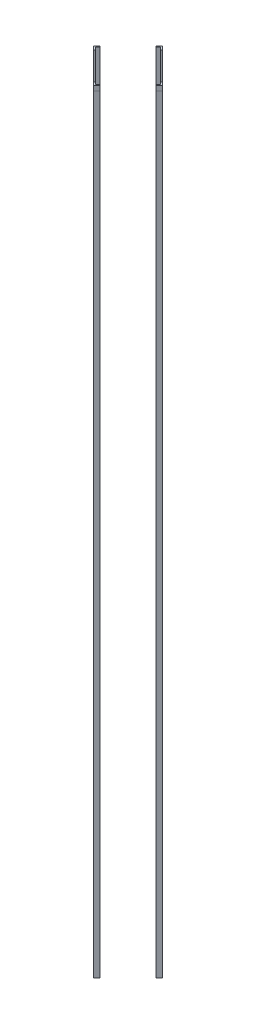
ISO-10303-21;
HEADER;
FILE_DESCRIPTION(('STEP AP214'),'2;1');
FILE_NAME('part.step','',(''),(''),'','','');
FILE_SCHEMA(('AUTOMOTIVE_DESIGN { 1 0 10303 214 1 1 1 1 }'));
ENDSEC;
DATA;
#1=APPLICATION_CONTEXT('core data for automotive mechanical design processes');
#2=APPLICATION_PROTOCOL_DEFINITION('international standard','automotive_design',2000,#1);
#3=PRODUCT_CONTEXT('',#1,'mechanical');
#4=PRODUCT('Part','Part','',(#3));
#5=PRODUCT_RELATED_PRODUCT_CATEGORY('part','',(#4));
#6=PRODUCT_DEFINITION_FORMATION('','',#4);
#7=PRODUCT_DEFINITION_CONTEXT('part definition',#1,'design');
#8=PRODUCT_DEFINITION('design','',#6,#7);
#9=PRODUCT_DEFINITION_SHAPE('','',#8);
#10=(LENGTH_UNIT() NAMED_UNIT(*) SI_UNIT(.MILLI.,.METRE.));
#11=(NAMED_UNIT(*) PLANE_ANGLE_UNIT() SI_UNIT($,.RADIAN.));
#12=(NAMED_UNIT(*) SI_UNIT($,.STERADIAN.) SOLID_ANGLE_UNIT());
#13=UNCERTAINTY_MEASURE_WITH_UNIT(LENGTH_MEASURE(1.E-05),#10,'distance_accuracy_value','');
#14=(GEOMETRIC_REPRESENTATION_CONTEXT(3) GLOBAL_UNCERTAINTY_ASSIGNED_CONTEXT((#13)) GLOBAL_UNIT_ASSIGNED_CONTEXT((#10,
#11,#12)) REPRESENTATION_CONTEXT('',''));
#15=CARTESIAN_POINT('',(0.,0.,0.));
#16=DIRECTION('',(0.,0.,1.));
#17=DIRECTION('',(1.,0.,0.));
#18=AXIS2_PLACEMENT_3D('',#15,#16,#17);
#19=CARTESIAN_POINT('',(-85.7940292392965,2133.6,-8.98025612106698));
#20=DIRECTION('',(0.707106781186548,0.,0.707106781186547));
#21=DIRECTION('',(0.707106781186547,0.,-0.707106781186548));
#22=AXIS2_PLACEMENT_3D('',#19,#20,#21);
#23=PLANE('',#22);
#24=DIRECTION('',(-0.707106781186547,0.,0.707106781186548));
#25=VECTOR('',#24,1.);
#26=CARTESIAN_POINT('',(-85.7940292392965,0.,-8.98025612106698));
#27=LINE('',#26,#25);
#28=CARTESIAN_POINT('',(-85.7940292392965,0.,-8.98025612106698));
#29=VERTEX_POINT('',#28);
#30=CARTESIAN_POINT('',(-94.7742853603657,0.,2.17296172318352E-12));
#31=VERTEX_POINT('',#30);
#32=EDGE_CURVE('E128',#29,#31,#27,.T.);
#33=ORIENTED_EDGE('',*,*,#32,.T.);
#34=DIRECTION('',(0.,-1.,0.));
#35=VECTOR('',#34,1.);
#36=CARTESIAN_POINT('',(-94.7742853603657,2133.6,2.17296172318352E-12));
#37=LINE('',#36,#35);
#38=CARTESIAN_POINT('',(-94.7742853603657,2133.6,2.17296172318352E-12));
#39=VERTEX_POINT('',#38);
#40=EDGE_CURVE('E12',#39,#31,#37,.T.);
#41=ORIENTED_EDGE('',*,*,#40,.F.);
#42=DIRECTION('',(-0.707106781186547,0.,0.707106781186548));
#43=VECTOR('',#42,1.);
#44=CARTESIAN_POINT('',(-85.7940292392965,2133.6,-8.98025612106698));
#45=LINE('',#44,#43);
#46=CARTESIAN_POINT('',(-85.7940292392965,2133.6,-8.98025612106698));
#47=VERTEX_POINT('',#46);
#48=EDGE_CURVE('E138',#47,#39,#45,.T.);
#49=ORIENTED_EDGE('',*,*,#48,.F.);
#50=DIRECTION('',(0.,-1.,0.));
#51=VECTOR('',#50,1.);
#52=CARTESIAN_POINT('',(-85.7940292392965,2133.6,-8.98025612106698));
#53=LINE('',#52,#51);
#54=EDGE_CURVE('E124',#47,#29,#53,.T.);
#55=ORIENTED_EDGE('',*,*,#54,.T.);
#56=EDGE_LOOP('',(#33,#41,#49,#55));
#57=FACE_BOUND('',#56,.T.);
#58=ADVANCED_FACE('F44',(#57),#23,.F.);
#59=CARTESIAN_POINT('',(-94.7742853603657,2133.6,2.17296172318352E-12));
#60=DIRECTION('',(0.707106781186548,0.,-0.707106781186547));
#61=DIRECTION('',(-0.707106781186547,0.,-0.707106781186548));
#62=AXIS2_PLACEMENT_3D('',#59,#60,#61);
#63=PLANE('',#62);
#64=DIRECTION('',(0.707106781186547,0.,0.707106781186548));
#65=VECTOR('',#64,1.);
#66=CARTESIAN_POINT('',(-94.7742853603657,0.,2.17296172318352E-12));
#67=LINE('',#66,#65);
#68=CARTESIAN_POINT('',(-85.7940292392965,0.,8.98025612107132));
#69=VERTEX_POINT('',#68);
#70=EDGE_CURVE('E131',#31,#69,#67,.T.);
#71=ORIENTED_EDGE('',*,*,#70,.T.);
#72=DIRECTION('',(0.,-1.,0.));
#73=VECTOR('',#72,1.);
#74=CARTESIAN_POINT('',(-85.7940292392965,2133.6,8.98025612107132));
#75=LINE('',#74,#73);
#76=CARTESIAN_POINT('',(-85.7940292392965,2133.6,8.98025612107132));
#77=VERTEX_POINT('',#76);
#78=EDGE_CURVE('E52',#77,#69,#75,.T.);
#79=ORIENTED_EDGE('',*,*,#78,.F.);
#80=DIRECTION('',(0.707106781186547,0.,0.707106781186548));
#81=VECTOR('',#80,1.);
#82=CARTESIAN_POINT('',(-94.7742853603657,2133.6,2.17296172318352E-12));
#83=LINE('',#82,#81);
#84=EDGE_CURVE('E97',#39,#77,#83,.T.);
#85=ORIENTED_EDGE('',*,*,#84,.F.);
#86=ORIENTED_EDGE('',*,*,#40,.T.);
#87=EDGE_LOOP('',(#71,#79,#85,#86));
#88=FACE_BOUND('',#87,.T.);
#89=ADVANCED_FACE('F162',(#88),#63,.F.);
#90=CARTESIAN_POINT('',(-85.7940292392965,2133.6,8.98025612107132));
#91=DIRECTION('',(-0.707106781186546,0.,-0.707106781186549));
#92=DIRECTION('',(-0.707106781186549,0.,0.707106781186546));
#93=AXIS2_PLACEMENT_3D('',#90,#91,#92);
#94=PLANE('',#93);
#95=DIRECTION('',(0.707106781186549,0.,-0.707106781186546));
#96=VECTOR('',#95,1.);
#97=CARTESIAN_POINT('',(-85.7940292392965,0.,8.98025612107132));
#98=LINE('',#97,#96);
#99=CARTESIAN_POINT('',(-83.5489652090292,0.,6.73519209080404));
#100=VERTEX_POINT('',#99);
#101=EDGE_CURVE('E133',#69,#100,#98,.T.);
#102=ORIENTED_EDGE('',*,*,#101,.T.);
#103=DIRECTION('',(0.,-1.,0.));
#104=VECTOR('',#103,1.);
#105=CARTESIAN_POINT('',(-83.5489652090292,2133.6,6.73519209080404));
#106=LINE('',#105,#104);
#107=CARTESIAN_POINT('',(-83.5489652090292,2133.6,6.73519209080404));
#108=VERTEX_POINT('',#107);
#109=EDGE_CURVE('E119',#108,#100,#106,.T.);
#110=ORIENTED_EDGE('',*,*,#109,.F.);
#111=DIRECTION('',(0.707106781186549,0.,-0.707106781186546));
#112=VECTOR('',#111,1.);
#113=CARTESIAN_POINT('',(-85.7940292392965,2133.6,8.98025612107132));
#114=LINE('',#113,#112);
#115=EDGE_CURVE('E110',#77,#108,#114,.T.);
#116=ORIENTED_EDGE('',*,*,#115,.F.);
#117=ORIENTED_EDGE('',*,*,#78,.T.);
#118=EDGE_LOOP('',(#102,#110,#116,#117));
#119=FACE_BOUND('',#118,.T.);
#120=ADVANCED_FACE('F144',(#119),#94,.F.);
#121=CARTESIAN_POINT('',(-83.5489652090292,2133.6,6.73519209080404));
#122=DIRECTION('',(-0.707106781186547,0.,0.707106781186548));
#123=DIRECTION('',(0.707106781186548,0.,0.707106781186547));
#124=AXIS2_PLACEMENT_3D('',#121,#122,#123);
#125=PLANE('',#124);
#126=DIRECTION('',(-0.707106781186548,0.,-0.707106781186547));
#127=VECTOR('',#126,1.);
#128=CARTESIAN_POINT('',(-83.5489652090292,0.,6.73519209080404));
#129=LINE('',#128,#127);
#130=CARTESIAN_POINT('',(-90.2841572998311,0.,2.18498927560865E-12));
#131=VERTEX_POINT('',#130);
#132=EDGE_CURVE('E118',#100,#131,#129,.T.);
#133=ORIENTED_EDGE('',*,*,#132,.T.);
#134=DIRECTION('',(0.,-1.,0.));
#135=VECTOR('',#134,1.);
#136=CARTESIAN_POINT('',(-90.2841572998311,2133.6,2.18498927560865E-12));
#137=LINE('',#136,#135);
#138=CARTESIAN_POINT('',(-90.2841572998311,2133.6,2.18498927560865E-12));
#139=VERTEX_POINT('',#138);
#140=EDGE_CURVE('E115',#139,#131,#137,.T.);
#141=ORIENTED_EDGE('',*,*,#140,.F.);
#142=DIRECTION('',(-0.707106781186548,0.,-0.707106781186547));
#143=VECTOR('',#142,1.);
#144=CARTESIAN_POINT('',(-83.5489652090292,2133.6,6.73519209080404));
#145=LINE('',#144,#143);
#146=EDGE_CURVE('E104',#108,#139,#145,.T.);
#147=ORIENTED_EDGE('',*,*,#146,.F.);
#148=ORIENTED_EDGE('',*,*,#109,.T.);
#149=EDGE_LOOP('',(#133,#141,#147,#148));
#150=FACE_BOUND('',#149,.T.);
#151=ADVANCED_FACE('F116',(#150),#125,.F.);
#152=CARTESIAN_POINT('',(-90.2841572998311,2133.6,2.18498927560865E-12));
#153=DIRECTION('',(-0.707106781186548,0.,-0.707106781186547));
#154=DIRECTION('',(-0.707106781186547,0.,0.707106781186548));
#155=AXIS2_PLACEMENT_3D('',#152,#153,#154);
#156=PLANE('',#155);
#157=DIRECTION('',(0.707106781186547,0.,-0.707106781186548));
#158=VECTOR('',#157,1.);
#159=CARTESIAN_POINT('',(-90.2841572998311,0.,2.18498927560865E-12));
#160=LINE('',#159,#158);
#161=CARTESIAN_POINT('',(-83.5489652090292,0.,-6.73519209079969));
#162=VERTEX_POINT('',#161);
#163=EDGE_CURVE('E83',#131,#162,#160,.T.);
#164=ORIENTED_EDGE('',*,*,#163,.T.);
#165=DIRECTION('',(0.,-1.,0.));
#166=VECTOR('',#165,1.);
#167=CARTESIAN_POINT('',(-83.5489652090292,2133.6,-6.73519209079969));
#168=LINE('',#167,#166);
#169=CARTESIAN_POINT('',(-83.5489652090292,2133.6,-6.73519209079969));
#170=VERTEX_POINT('',#169);
#171=EDGE_CURVE('E120',#170,#162,#168,.T.);
#172=ORIENTED_EDGE('',*,*,#171,.F.);
#173=DIRECTION('',(0.707106781186547,0.,-0.707106781186548));
#174=VECTOR('',#173,1.);
#175=CARTESIAN_POINT('',(-90.2841572998311,2133.6,2.18498927560865E-12));
#176=LINE('',#175,#174);
#177=EDGE_CURVE('E108',#139,#170,#176,.T.);
#178=ORIENTED_EDGE('',*,*,#177,.F.);
#179=ORIENTED_EDGE('',*,*,#140,.T.);
#180=EDGE_LOOP('',(#164,#172,#178,#179));
#181=FACE_BOUND('',#180,.T.);
#182=ADVANCED_FACE('F122',(#181),#156,.F.);
#183=CARTESIAN_POINT('',(-83.5489652090292,2133.6,-6.73519209079969));
#184=DIRECTION('',(-0.707106781186547,0.,0.707106781186548));
#185=DIRECTION('',(0.707106781186548,0.,0.707106781186547));
#186=AXIS2_PLACEMENT_3D('',#183,#184,#185);
#187=PLANE('',#186);
#188=DIRECTION('',(-0.707106781186548,0.,-0.707106781186547));
#189=VECTOR('',#188,1.);
#190=CARTESIAN_POINT('',(-83.5489652090292,0.,-6.73519209079969));
#191=LINE('',#190,#189);
#192=EDGE_CURVE('E89',#162,#29,#191,.T.);
#193=ORIENTED_EDGE('',*,*,#192,.T.);
#194=ORIENTED_EDGE('',*,*,#54,.F.);
#195=DIRECTION('',(-0.707106781186548,0.,-0.707106781186547));
#196=VECTOR('',#195,1.);
#197=CARTESIAN_POINT('',(-83.5489652090292,2133.6,-6.73519209079969));
#198=LINE('',#197,#196);
#199=EDGE_CURVE('E60',#170,#47,#198,.T.);
#200=ORIENTED_EDGE('',*,*,#199,.F.);
#201=ORIENTED_EDGE('',*,*,#171,.T.);
#202=EDGE_LOOP('',(#193,#194,#200,#201));
#203=FACE_BOUND('',#202,.T.);
#204=ADVANCED_FACE('F151',(#203),#187,.F.);
#205=CARTESIAN_POINT('',(0.,2133.6,0.));
#206=DIRECTION('',(0.,1.,0.));
#207=DIRECTION('',(0.,0.,1.));
#208=AXIS2_PLACEMENT_3D('',#205,#206,#207);
#209=PLANE('',#208);
#210=ORIENTED_EDGE('',*,*,#48,.T.);
#211=ORIENTED_EDGE('',*,*,#84,.T.);
#212=ORIENTED_EDGE('',*,*,#115,.T.);
#213=ORIENTED_EDGE('',*,*,#146,.T.);
#214=ORIENTED_EDGE('',*,*,#177,.T.);
#215=ORIENTED_EDGE('',*,*,#199,.T.);
#216=EDGE_LOOP('',(#210,#211,#212,#213,#214,#215));
#217=FACE_BOUND('',#216,.T.);
#218=ADVANCED_FACE('F106',(#217),#209,.T.);
#219=CARTESIAN_POINT('',(0.,0.,0.));
#220=DIRECTION('',(0.,1.,0.));
#221=DIRECTION('',(0.,0.,1.));
#222=AXIS2_PLACEMENT_3D('',#219,#220,#221);
#223=PLANE('',#222);
#224=ORIENTED_EDGE('',*,*,#32,.F.);
#225=ORIENTED_EDGE('',*,*,#192,.F.);
#226=ORIENTED_EDGE('',*,*,#163,.F.);
#227=ORIENTED_EDGE('',*,*,#132,.F.);
#228=ORIENTED_EDGE('',*,*,#101,.F.);
#229=ORIENTED_EDGE('',*,*,#70,.F.);
#230=EDGE_LOOP('',(#224,#225,#226,#227,#228,#229));
#231=FACE_BOUND('',#230,.T.);
#232=ADVANCED_FACE('F147',(#231),#223,.F.);
#233=CLOSED_SHELL('',(#58,#89,#120,#151,#182,#204,#218,#232));
#234=MANIFOLD_SOLID_BREP('B2',#233);
#235=CARTESIAN_POINT('',(4.66862972428168E-12,2133.6,94.7742853603679));
#236=DIRECTION('',(-0.707106781186547,0.,-0.707106781186548));
#237=DIRECTION('',(-0.707106781186548,0.,0.707106781186547));
#238=AXIS2_PLACEMENT_3D('',#235,#236,#237);
#239=PLANE('',#238);
#240=DIRECTION('',(0.707106781186547,0.,-0.707106781186547));
#241=VECTOR('',#240,1.);
#242=CARTESIAN_POINT('',(4.7045700668491E-12,2120.9,94.7742853603679));
#243=LINE('',#242,#241);
#244=CARTESIAN_POINT('',(4.7045700668491E-12,2120.9,94.7742853603679));
#245=VERTEX_POINT('',#244);
#246=CARTESIAN_POINT('',(8.98025612107385,2120.9,85.7940292392987));
#247=VERTEX_POINT('',#246);
#248=EDGE_CURVE('E322',#245,#247,#243,.T.);
#249=ORIENTED_EDGE('',*,*,#248,.F.);
#250=DIRECTION('',(0.,-1.,0.));
#251=VECTOR('',#250,1.);
#252=CARTESIAN_POINT('',(4.66862972428168E-12,2133.6,94.7742853603679));
#253=LINE('',#252,#251);
#254=CARTESIAN_POINT('',(4.66862972428168E-12,0.,94.7742853603679));
#255=VERTEX_POINT('',#254);
#256=EDGE_CURVE('E42',#245,#255,#253,.T.);
#257=ORIENTED_EDGE('',*,*,#256,.T.);
#258=DIRECTION('',(0.707106781186548,0.,-0.707106781186547));
#259=VECTOR('',#258,1.);
#260=CARTESIAN_POINT('',(4.66862972428168E-12,0.,94.7742853603679));
#261=LINE('',#260,#259);
#262=CARTESIAN_POINT('',(8.98025612107382,0.,85.7940292392987));
#263=VERTEX_POINT('',#262);
#264=EDGE_CURVE('E328',#255,#263,#261,.T.);
#265=ORIENTED_EDGE('',*,*,#264,.T.);
#266=DIRECTION('',(0.,-1.,0.));
#267=VECTOR('',#266,1.);
#268=CARTESIAN_POINT('',(8.98025612107382,2133.6,85.7940292392987));
#269=LINE('',#268,#267);
#270=EDGE_CURVE('E239',#247,#263,#269,.T.);
#271=ORIENTED_EDGE('',*,*,#270,.F.);
#272=EDGE_LOOP('',(#249,#257,#265,#271));
#273=FACE_BOUND('',#272,.T.);
#274=ADVANCED_FACE('F230',(#273),#239,.F.);
#275=CARTESIAN_POINT('',(-8.98025612106449,2133.6,85.7940292392987));
#276=DIRECTION('',(0.707106781186547,0.,-0.707106781186548));
#277=DIRECTION('',(-0.707106781186548,0.,-0.707106781186547));
#278=AXIS2_PLACEMENT_3D('',#275,#276,#277);
#279=PLANE('',#278);
#280=DIRECTION('',(0.707106781186548,0.,0.707106781186547));
#281=VECTOR('',#280,1.);
#282=CARTESIAN_POINT('',(-8.98025612106449,0.,85.7940292392987));
#283=LINE('',#282,#281);
#284=CARTESIAN_POINT('',(-8.98025612106449,0.,85.7940292392987));
#285=VERTEX_POINT('',#284);
#286=EDGE_CURVE('E326',#285,#255,#283,.T.);
#287=ORIENTED_EDGE('',*,*,#286,.T.);
#288=ORIENTED_EDGE('',*,*,#256,.F.);
#289=DIRECTION('',(-0.707106781186547,0.,-0.707106781186548));
#290=VECTOR('',#289,1.);
#291=CARTESIAN_POINT('',(0.0179605122468429,2120.9,94.79224587261));
#292=LINE('',#291,#290);
#293=CARTESIAN_POINT('',(0.0179605122468429,2120.9,94.79224587261));
#294=VERTEX_POINT('',#293);
#295=EDGE_CURVE('E306',#294,#245,#292,.T.);
#296=ORIENTED_EDGE('',*,*,#295,.F.);
#297=DIRECTION('',(0.,-1.,0.));
#298=VECTOR('',#297,1.);
#299=CARTESIAN_POINT('',(0.0179605122468429,2133.6,94.79224587261));
#300=LINE('',#299,#298);
#301=CARTESIAN_POINT('',(0.0179605122468429,2133.6,94.79224587261));
#302=VERTEX_POINT('',#301);
#303=EDGE_CURVE('E314',#302,#294,#300,.T.);
#304=ORIENTED_EDGE('',*,*,#303,.F.);
#305=DIRECTION('',(0.707106781186548,0.,0.707106781186547));
#306=VECTOR('',#305,1.);
#307=CARTESIAN_POINT('',(-8.98025612106449,2133.6,85.7940292392987));
#308=LINE('',#307,#306);
#309=CARTESIAN_POINT('',(-8.98025612106449,2133.6,85.7940292392987));
#310=VERTEX_POINT('',#309);
#311=EDGE_CURVE('E333',#310,#302,#308,.T.);
#312=ORIENTED_EDGE('',*,*,#311,.F.);
#313=DIRECTION('',(0.,-1.,0.));
#314=VECTOR('',#313,1.);
#315=CARTESIAN_POINT('',(-8.98025612106449,2133.6,85.7940292392987));
#316=LINE('',#315,#314);
#317=EDGE_CURVE('E340',#310,#285,#316,.T.);
#318=ORIENTED_EDGE('',*,*,#317,.T.);
#319=EDGE_LOOP('',(#287,#288,#296,#304,#312,#318));
#320=FACE_BOUND('',#319,.T.);
#321=ADVANCED_FACE('F232',(#320),#279,.F.);
#322=CARTESIAN_POINT('',(8.98025612107382,2133.6,85.7940292392987));
#323=DIRECTION('',(-0.707106781186549,0.,0.707106781186546));
#324=DIRECTION('',(0.707106781186546,0.,0.707106781186549));
#325=AXIS2_PLACEMENT_3D('',#322,#323,#324);
#326=PLANE('',#325);
#327=DIRECTION('',(-0.707106781186546,0.,-0.707106781186549));
#328=VECTOR('',#327,1.);
#329=CARTESIAN_POINT('',(8.98025612107382,0.,85.7940292392987));
#330=LINE('',#329,#328);
#331=CARTESIAN_POINT('',(6.73519209080653,0.,83.5489652090314));
#332=VERTEX_POINT('',#331);
#333=EDGE_CURVE('E344',#263,#332,#330,.T.);
#334=ORIENTED_EDGE('',*,*,#333,.T.);
#335=DIRECTION('',(0.,-1.,0.));
#336=VECTOR('',#335,1.);
#337=CARTESIAN_POINT('',(6.73519209080653,2133.6,83.5489652090314));
#338=LINE('',#337,#336);
#339=CARTESIAN_POINT('',(6.73519209080653,2133.6,83.5489652090314));
#340=VERTEX_POINT('',#339);
#341=EDGE_CURVE('E355',#340,#332,#338,.T.);
#342=ORIENTED_EDGE('',*,*,#341,.F.);
#343=DIRECTION('',(-0.707106781186546,0.,-0.707106781186549));
#344=VECTOR('',#343,1.);
#345=CARTESIAN_POINT('',(8.98025612107382,2133.6,85.7940292392987));
#346=LINE('',#345,#344);
#347=CARTESIAN_POINT('',(8.99821663331599,2133.6,85.8119897515409));
#348=VERTEX_POINT('',#347);
#349=EDGE_CURVE('E283',#348,#340,#346,.T.);
#350=ORIENTED_EDGE('',*,*,#349,.F.);
#351=DIRECTION('',(0.,1.,0.));
#352=VECTOR('',#351,1.);
#353=CARTESIAN_POINT('',(8.99821663331599,2133.6,85.8119897515409));
#354=LINE('',#353,#352);
#355=CARTESIAN_POINT('',(8.99821663331599,2120.9,85.8119897515409));
#356=VERTEX_POINT('',#355);
#357=EDGE_CURVE('E313',#356,#348,#354,.T.);
#358=ORIENTED_EDGE('',*,*,#357,.F.);
#359=DIRECTION('',(-0.707106781186547,0.,-0.707106781186548));
#360=VECTOR('',#359,1.);
#361=CARTESIAN_POINT('',(8.99821663331599,2120.9,85.8119897515409));
#362=LINE('',#361,#360);
#363=EDGE_CURVE('E309',#356,#247,#362,.T.);
#364=ORIENTED_EDGE('',*,*,#363,.T.);
#365=ORIENTED_EDGE('',*,*,#270,.T.);
#366=EDGE_LOOP('',(#334,#342,#350,#358,#364,#365));
#367=FACE_BOUND('',#366,.T.);
#368=ADVANCED_FACE('F359',(#367),#326,.F.);
#369=CARTESIAN_POINT('',(6.73519209080653,2133.6,83.5489652090314));
#370=DIRECTION('',(0.707106781186548,0.,0.707106781186547));
#371=DIRECTION('',(0.707106781186547,0.,-0.707106781186548));
#372=AXIS2_PLACEMENT_3D('',#369,#370,#371);
#373=PLANE('',#372);
#374=DIRECTION('',(-0.707106781186547,0.,0.707106781186548));
#375=VECTOR('',#374,1.);
#376=CARTESIAN_POINT('',(6.73519209080653,0.,83.5489652090314));
#377=LINE('',#376,#375);
#378=CARTESIAN_POINT('',(4.68093221775466E-12,0.,90.2841572998333));
#379=VERTEX_POINT('',#378);
#380=EDGE_CURVE('E346',#332,#379,#377,.T.);
#381=ORIENTED_EDGE('',*,*,#380,.T.);
#382=DIRECTION('',(0.,-1.,0.));
#383=VECTOR('',#382,1.);
#384=CARTESIAN_POINT('',(4.68093221775466E-12,2133.6,90.2841572998333));
#385=LINE('',#384,#383);
#386=CARTESIAN_POINT('',(4.68093221775466E-12,2133.6,90.2841572998333));
#387=VERTEX_POINT('',#386);
#388=EDGE_CURVE('E353',#387,#379,#385,.T.);
#389=ORIENTED_EDGE('',*,*,#388,.F.);
#390=DIRECTION('',(-0.707106781186547,0.,0.707106781186548));
#391=VECTOR('',#390,1.);
#392=CARTESIAN_POINT('',(6.73519209080653,2133.6,83.5489652090314));
#393=LINE('',#392,#391);
#394=EDGE_CURVE('E336',#340,#387,#393,.T.);
#395=ORIENTED_EDGE('',*,*,#394,.F.);
#396=ORIENTED_EDGE('',*,*,#341,.T.);
#397=EDGE_LOOP('',(#381,#389,#395,#396));
#398=FACE_BOUND('',#397,.T.);
#399=ADVANCED_FACE('F369',(#398),#373,.F.);
#400=CARTESIAN_POINT('',(4.68093221775466E-12,2133.6,90.2841572998333));
#401=DIRECTION('',(-0.707106781186547,0.,0.707106781186548));
#402=DIRECTION('',(0.707106781186548,0.,0.707106781186547));
#403=AXIS2_PLACEMENT_3D('',#400,#401,#402);
#404=PLANE('',#403);
#405=DIRECTION('',(-0.707106781186548,0.,-0.707106781186547));
#406=VECTOR('',#405,1.);
#407=CARTESIAN_POINT('',(4.68093221775466E-12,0.,90.2841572998333));
#408=LINE('',#407,#406);
#409=CARTESIAN_POINT('',(-6.7351920907972,0.,83.5489652090314));
#410=VERTEX_POINT('',#409);
#411=EDGE_CURVE('E270',#379,#410,#408,.T.);
#412=ORIENTED_EDGE('',*,*,#411,.T.);
#413=DIRECTION('',(0.,-1.,0.));
#414=VECTOR('',#413,1.);
#415=CARTESIAN_POINT('',(-6.7351920907972,2133.6,83.5489652090314));
#416=LINE('',#415,#414);
#417=CARTESIAN_POINT('',(-6.7351920907972,2133.6,83.5489652090314));
#418=VERTEX_POINT('',#417);
#419=EDGE_CURVE('E351',#418,#410,#416,.T.);
#420=ORIENTED_EDGE('',*,*,#419,.F.);
#421=DIRECTION('',(-0.707106781186548,0.,-0.707106781186547));
#422=VECTOR('',#421,1.);
#423=CARTESIAN_POINT('',(4.68093221775466E-12,2133.6,90.2841572998333));
#424=LINE('',#423,#422);
#425=EDGE_CURVE('E338',#387,#418,#424,.T.);
#426=ORIENTED_EDGE('',*,*,#425,.F.);
#427=ORIENTED_EDGE('',*,*,#388,.T.);
#428=EDGE_LOOP('',(#412,#420,#426,#427));
#429=FACE_BOUND('',#428,.T.);
#430=ADVANCED_FACE('F372',(#429),#404,.F.);
#431=CARTESIAN_POINT('',(-6.7351920907972,2133.6,83.5489652090314));
#432=DIRECTION('',(0.707106781186548,0.,0.707106781186547));
#433=DIRECTION('',(0.707106781186547,0.,-0.707106781186548));
#434=AXIS2_PLACEMENT_3D('',#431,#432,#433);
#435=PLANE('',#434);
#436=DIRECTION('',(-0.707106781186547,0.,0.707106781186548));
#437=VECTOR('',#436,1.);
#438=CARTESIAN_POINT('',(-6.7351920907972,0.,83.5489652090314));
#439=LINE('',#438,#437);
#440=EDGE_CURVE('E276',#410,#285,#439,.T.);
#441=ORIENTED_EDGE('',*,*,#440,.T.);
#442=ORIENTED_EDGE('',*,*,#317,.F.);
#443=DIRECTION('',(-0.707106781186547,0.,0.707106781186548));
#444=VECTOR('',#443,1.);
#445=CARTESIAN_POINT('',(-6.7351920907972,2133.6,83.5489652090314));
#446=LINE('',#445,#444);
#447=EDGE_CURVE('E247',#418,#310,#446,.T.);
#448=ORIENTED_EDGE('',*,*,#447,.F.);
#449=ORIENTED_EDGE('',*,*,#419,.T.);
#450=EDGE_LOOP('',(#441,#442,#448,#449));
#451=FACE_BOUND('',#450,.T.);
#452=ADVANCED_FACE('F375',(#451),#435,.F.);
#453=CARTESIAN_POINT('',(0.,2133.6,0.));
#454=DIRECTION('',(0.,1.,0.));
#455=DIRECTION('',(0.,0.,1.));
#456=AXIS2_PLACEMENT_3D('',#453,#454,#455);
#457=PLANE('',#456);
#458=ORIENTED_EDGE('',*,*,#311,.T.);
#459=DIRECTION('',(-0.707106781186547,0.,0.707106781186547));
#460=VECTOR('',#459,1.);
#461=CARTESIAN_POINT('',(0.0179605122468429,2133.6,94.79224587261));
#462=LINE('',#461,#460);
#463=EDGE_CURVE('E319',#348,#302,#462,.T.);
#464=ORIENTED_EDGE('',*,*,#463,.F.);
#465=ORIENTED_EDGE('',*,*,#349,.T.);
#466=ORIENTED_EDGE('',*,*,#394,.T.);
#467=ORIENTED_EDGE('',*,*,#425,.T.);
#468=ORIENTED_EDGE('',*,*,#447,.T.);
#469=EDGE_LOOP('',(#458,#464,#465,#466,#467,#468));
#470=FACE_BOUND('',#469,.T.);
#471=ADVANCED_FACE('F373',(#470),#457,.T.);
#472=CARTESIAN_POINT('',(0.,0.,0.));
#473=DIRECTION('',(0.,1.,0.));
#474=DIRECTION('',(0.,0.,1.));
#475=AXIS2_PLACEMENT_3D('',#472,#473,#474);
#476=PLANE('',#475);
#477=ORIENTED_EDGE('',*,*,#286,.F.);
#478=ORIENTED_EDGE('',*,*,#440,.F.);
#479=ORIENTED_EDGE('',*,*,#411,.F.);
#480=ORIENTED_EDGE('',*,*,#380,.F.);
#481=ORIENTED_EDGE('',*,*,#333,.F.);
#482=ORIENTED_EDGE('',*,*,#264,.F.);
#483=EDGE_LOOP('',(#477,#478,#479,#480,#481,#482));
#484=FACE_BOUND('',#483,.T.);
#485=ADVANCED_FACE('F366',(#484),#476,.F.);
#486=CARTESIAN_POINT('',(0.0179605122468429,2120.9,94.79224587261));
#487=DIRECTION('',(0.,1.,0.));
#488=DIRECTION('',(0.,0.,1.));
#489=AXIS2_PLACEMENT_3D('',#486,#487,#488);
#490=PLANE('',#489);
#491=ORIENTED_EDGE('',*,*,#248,.T.);
#492=ORIENTED_EDGE('',*,*,#363,.F.);
#493=DIRECTION('',(0.707106781186547,0.,-0.707106781186547));
#494=VECTOR('',#493,1.);
#495=CARTESIAN_POINT('',(0.0179605122468429,2120.9,94.79224587261));
#496=LINE('',#495,#494);
#497=EDGE_CURVE('E302',#294,#356,#496,.T.);
#498=ORIENTED_EDGE('',*,*,#497,.F.);
#499=ORIENTED_EDGE('',*,*,#295,.T.);
#500=EDGE_LOOP('',(#491,#492,#498,#499));
#501=FACE_BOUND('',#500,.T.);
#502=ADVANCED_FACE('F304',(#501),#490,.F.);
#503=CARTESIAN_POINT('',(47.4051031924284,0.,47.4051031924284));
#504=DIRECTION('',(0.707106781186548,0.,0.707106781186548));
#505=DIRECTION('',(0.707106781186548,0.,-0.707106781186548));
#506=AXIS2_PLACEMENT_3D('',#503,#504,#505);
#507=PLANE('',#506);
#508=ORIENTED_EDGE('',*,*,#303,.T.);
#509=ORIENTED_EDGE('',*,*,#497,.T.);
#510=ORIENTED_EDGE('',*,*,#357,.T.);
#511=ORIENTED_EDGE('',*,*,#463,.T.);
#512=EDGE_LOOP('',(#508,#509,#510,#511));
#513=FACE_BOUND('',#512,.T.);
#514=ADVANCED_FACE('F318',(#513),#507,.T.);
#515=CLOSED_SHELL('',(#274,#321,#368,#399,#430,#452,#471,#485,#502,#514));
#516=MANIFOLD_SOLID_BREP('B6',#515);
#517=CARTESIAN_POINT('',(85.7940292393012,2133.6,8.98025612106666));
#518=DIRECTION('',(-0.707106781186548,0.,-0.707106781186547));
#519=DIRECTION('',(-0.707106781186547,0.,0.707106781186548));
#520=AXIS2_PLACEMENT_3D('',#517,#518,#519);
#521=PLANE('',#520);
#522=DIRECTION('',(0.707106781186547,0.,-0.707106781186548));
#523=VECTOR('',#522,1.);
#524=CARTESIAN_POINT('',(85.7940292393012,2120.9,8.98025612106668));
#525=LINE('',#524,#523);
#526=CARTESIAN_POINT('',(85.7940292393012,2120.9,8.98025612106668));
#527=VERTEX_POINT('',#526);
#528=CARTESIAN_POINT('',(94.7742853603704,2120.9,-2.47718512369488E-12));
#529=VERTEX_POINT('',#528);
#530=EDGE_CURVE('E567',#527,#529,#525,.T.);
#531=ORIENTED_EDGE('',*,*,#530,.F.);
#532=DIRECTION('',(0.,-1.,0.));
#533=VECTOR('',#532,1.);
#534=CARTESIAN_POINT('',(85.7940292393012,2133.6,8.98025612106666));
#535=LINE('',#534,#533);
#536=CARTESIAN_POINT('',(85.7940292393012,0.,8.98025612106666));
#537=VERTEX_POINT('',#536);
#538=EDGE_CURVE('E522',#527,#537,#535,.T.);
#539=ORIENTED_EDGE('',*,*,#538,.T.);
#540=DIRECTION('',(0.707106781186547,0.,-0.707106781186548));
#541=VECTOR('',#540,1.);
#542=CARTESIAN_POINT('',(85.7940292393012,0.,8.98025612106666));
#543=LINE('',#542,#541);
#544=CARTESIAN_POINT('',(94.7742853603704,0.,-2.49442212805027E-12));
#545=VERTEX_POINT('',#544);
#546=EDGE_CURVE('E570',#537,#545,#543,.T.);
#547=ORIENTED_EDGE('',*,*,#546,.T.);
#548=DIRECTION('',(0.,-1.,0.));
#549=VECTOR('',#548,1.);
#550=CARTESIAN_POINT('',(94.7742853603704,2133.6,-2.49442212805027E-12));
#551=LINE('',#550,#549);
#552=EDGE_CURVE('E228',#529,#545,#551,.T.);
#553=ORIENTED_EDGE('',*,*,#552,.F.);
#554=EDGE_LOOP('',(#531,#539,#547,#553));
#555=FACE_BOUND('',#554,.T.);
#556=ADVANCED_FACE('F476',(#555),#521,.F.);
#557=CARTESIAN_POINT('',(94.7742853603704,2133.6,-2.49442212805027E-12));
#558=DIRECTION('',(-0.707106781186548,0.,0.707106781186547));
#559=DIRECTION('',(0.707106781186547,0.,0.707106781186548));
#560=AXIS2_PLACEMENT_3D('',#557,#558,#559);
#561=PLANE('',#560);
#562=DIRECTION('',(-0.707106781186547,0.,-0.707106781186548));
#563=VECTOR('',#562,1.);
#564=CARTESIAN_POINT('',(94.7742853603704,0.,-2.49442212805027E-12));
#565=LINE('',#564,#563);
#566=CARTESIAN_POINT('',(85.7940292393012,0.,-8.98025612107165));
#567=VERTEX_POINT('',#566);
#568=EDGE_CURVE('E572',#545,#567,#565,.T.);
#569=ORIENTED_EDGE('',*,*,#568,.T.);
#570=DIRECTION('',(0.,-1.,0.));
#571=VECTOR('',#570,1.);
#572=CARTESIAN_POINT('',(85.7940292393012,2133.6,-8.98025612107165));
#573=LINE('',#572,#571);
#574=CARTESIAN_POINT('',(85.7940292393012,2133.6,-8.98025612107165));
#575=VERTEX_POINT('',#574);
#576=EDGE_CURVE('E484',#575,#567,#573,.T.);
#577=ORIENTED_EDGE('',*,*,#576,.F.);
#578=DIRECTION('',(-0.707106781186547,0.,-0.707106781186548));
#579=VECTOR('',#578,1.);
#580=CARTESIAN_POINT('',(94.7742853603704,2133.6,-2.49442212805027E-12));
#581=LINE('',#580,#579);
#582=CARTESIAN_POINT('',(94.7922458726125,2133.6,0.0179605122396611));
#583=VERTEX_POINT('',#582);
#584=EDGE_CURVE('E529',#583,#575,#581,.T.);
#585=ORIENTED_EDGE('',*,*,#584,.F.);
#586=DIRECTION('',(0.,1.,0.));
#587=VECTOR('',#586,1.);
#588=CARTESIAN_POINT('',(94.7922458726125,2133.6,0.0179605122396611));
#589=LINE('',#588,#587);
#590=CARTESIAN_POINT('',(94.7922458726125,2120.9,0.0179605122396611));
#591=VERTEX_POINT('',#590);
#592=EDGE_CURVE('E558',#591,#583,#589,.T.);
#593=ORIENTED_EDGE('',*,*,#592,.F.);
#594=DIRECTION('',(-0.707106781186548,0.,-0.707106781186547));
#595=VECTOR('',#594,1.);
#596=CARTESIAN_POINT('',(94.7922458726125,2120.9,0.0179605122396611));
#597=LINE('',#596,#595);
#598=EDGE_CURVE('E554',#591,#529,#597,.T.);
#599=ORIENTED_EDGE('',*,*,#598,.T.);
#600=ORIENTED_EDGE('',*,*,#552,.T.);
#601=EDGE_LOOP('',(#569,#577,#585,#593,#599,#600));
#602=FACE_BOUND('',#601,.T.);
#603=ADVANCED_FACE('F622',(#602),#561,.F.);
#604=CARTESIAN_POINT('',(85.7940292393012,2133.6,-8.98025612107165));
#605=DIRECTION('',(0.707106781186546,0.,0.707106781186549));
#606=DIRECTION('',(0.707106781186549,0.,-0.707106781186546));
#607=AXIS2_PLACEMENT_3D('',#604,#605,#606);
#608=PLANE('',#607);
#609=DIRECTION('',(-0.707106781186549,0.,0.707106781186546));
#610=VECTOR('',#609,1.);
#611=CARTESIAN_POINT('',(85.7940292393012,0.,-8.98025612107165));
#612=LINE('',#611,#610);
#613=CARTESIAN_POINT('',(83.5489652090339,0.,-6.73519209080436));
#614=VERTEX_POINT('',#613);
#615=EDGE_CURVE('E587',#567,#614,#612,.T.);
#616=ORIENTED_EDGE('',*,*,#615,.T.);
#617=DIRECTION('',(0.,-1.,0.));
#618=VECTOR('',#617,1.);
#619=CARTESIAN_POINT('',(83.5489652090339,2133.6,-6.73519209080436));
#620=LINE('',#619,#618);
#621=CARTESIAN_POINT('',(83.5489652090339,2133.6,-6.73519209080436));
#622=VERTEX_POINT('',#621);
#623=EDGE_CURVE('E598',#622,#614,#620,.T.);
#624=ORIENTED_EDGE('',*,*,#623,.F.);
#625=DIRECTION('',(-0.707106781186549,0.,0.707106781186546));
#626=VECTOR('',#625,1.);
#627=CARTESIAN_POINT('',(85.7940292393012,2133.6,-8.98025612107165));
#628=LINE('',#627,#626);
#629=EDGE_CURVE('E578',#575,#622,#628,.T.);
#630=ORIENTED_EDGE('',*,*,#629,.F.);
#631=ORIENTED_EDGE('',*,*,#576,.T.);
#632=EDGE_LOOP('',(#616,#624,#630,#631));
#633=FACE_BOUND('',#632,.T.);
#634=ADVANCED_FACE('F604',(#633),#608,.F.);
#635=CARTESIAN_POINT('',(83.5489652090339,2133.6,-6.73519209080436));
#636=DIRECTION('',(0.707106781186547,0.,-0.707106781186548));
#637=DIRECTION('',(-0.707106781186548,0.,-0.707106781186547));
#638=AXIS2_PLACEMENT_3D('',#635,#636,#637);
#639=PLANE('',#638);
#640=DIRECTION('',(0.707106781186548,0.,0.707106781186547));
#641=VECTOR('',#640,1.);
#642=CARTESIAN_POINT('',(83.5489652090339,0.,-6.73519209080436));
#643=LINE('',#642,#641);
#644=CARTESIAN_POINT('',(90.2841572998358,0.,-2.5069995625711E-12));
#645=VERTEX_POINT('',#644);
#646=EDGE_CURVE('E589',#614,#645,#643,.T.);
#647=ORIENTED_EDGE('',*,*,#646,.T.);
#648=DIRECTION('',(0.,-1.,0.));
#649=VECTOR('',#648,1.);
#650=CARTESIAN_POINT('',(90.2841572998358,2133.6,-2.5069995625711E-12));
#651=LINE('',#650,#649);
#652=CARTESIAN_POINT('',(90.2841572998358,2133.6,-2.5069995625711E-12));
#653=VERTEX_POINT('',#652);
#654=EDGE_CURVE('E596',#653,#645,#651,.T.);
#655=ORIENTED_EDGE('',*,*,#654,.F.);
#656=DIRECTION('',(0.707106781186548,0.,0.707106781186547));
#657=VECTOR('',#656,1.);
#658=CARTESIAN_POINT('',(83.5489652090339,2133.6,-6.73519209080436));
#659=LINE('',#658,#657);
#660=EDGE_CURVE('E581',#622,#653,#659,.T.);
#661=ORIENTED_EDGE('',*,*,#660,.F.);
#662=ORIENTED_EDGE('',*,*,#623,.T.);
#663=EDGE_LOOP('',(#647,#655,#661,#662));
#664=FACE_BOUND('',#663,.T.);
#665=ADVANCED_FACE('F615',(#664),#639,.F.);
#666=CARTESIAN_POINT('',(90.2841572998358,2133.6,-2.5069995625711E-12));
#667=DIRECTION('',(0.707106781186548,0.,0.707106781186547));
#668=DIRECTION('',(0.707106781186547,0.,-0.707106781186548));
#669=AXIS2_PLACEMENT_3D('',#666,#667,#668);
#670=PLANE('',#669);
#671=DIRECTION('',(-0.707106781186547,0.,0.707106781186548));
#672=VECTOR('',#671,1.);
#673=CARTESIAN_POINT('',(90.2841572998358,0.,-2.5069995625711E-12));
#674=LINE('',#673,#672);
#675=CARTESIAN_POINT('',(83.5489652090339,0.,6.73519209079937));
#676=VERTEX_POINT('',#675);
#677=EDGE_CURVE('E514',#645,#676,#674,.T.);
#678=ORIENTED_EDGE('',*,*,#677,.T.);
#679=DIRECTION('',(0.,-1.,0.));
#680=VECTOR('',#679,1.);
#681=CARTESIAN_POINT('',(83.5489652090339,2133.6,6.73519209079937));
#682=LINE('',#681,#680);
#683=CARTESIAN_POINT('',(83.5489652090339,2133.6,6.73519209079937));
#684=VERTEX_POINT('',#683);
#685=EDGE_CURVE('E594',#684,#676,#682,.T.);
#686=ORIENTED_EDGE('',*,*,#685,.F.);
#687=DIRECTION('',(-0.707106781186547,0.,0.707106781186548));
#688=VECTOR('',#687,1.);
#689=CARTESIAN_POINT('',(90.2841572998358,2133.6,-2.5069995625711E-12));
#690=LINE('',#689,#688);
#691=EDGE_CURVE('E492',#653,#684,#690,.T.);
#692=ORIENTED_EDGE('',*,*,#691,.F.);
#693=ORIENTED_EDGE('',*,*,#654,.T.);
#694=EDGE_LOOP('',(#678,#686,#692,#693));
#695=FACE_BOUND('',#694,.T.);
#696=ADVANCED_FACE('F617',(#695),#670,.F.);
#697=CARTESIAN_POINT('',(83.5489652090339,2133.6,6.73519209079937));
#698=DIRECTION('',(0.707106781186547,0.,-0.707106781186548));
#699=DIRECTION('',(-0.707106781186548,0.,-0.707106781186547));
#700=AXIS2_PLACEMENT_3D('',#697,#698,#699);
#701=PLANE('',#700);
#702=DIRECTION('',(0.707106781186548,0.,0.707106781186547));
#703=VECTOR('',#702,1.);
#704=CARTESIAN_POINT('',(83.5489652090339,0.,6.73519209079937));
#705=LINE('',#704,#703);
#706=EDGE_CURVE('E579',#676,#537,#705,.T.);
#707=ORIENTED_EDGE('',*,*,#706,.T.);
#708=ORIENTED_EDGE('',*,*,#538,.F.);
#709=DIRECTION('',(-0.707106781186548,0.,-0.707106781186547));
#710=VECTOR('',#709,1.);
#711=CARTESIAN_POINT('',(85.8119897515434,2120.9,8.99821663330881));
#712=LINE('',#711,#710);
#713=CARTESIAN_POINT('',(85.8119897515434,2120.9,8.99821663330881));
#714=VERTEX_POINT('',#713);
#715=EDGE_CURVE('E552',#714,#527,#712,.T.);
#716=ORIENTED_EDGE('',*,*,#715,.F.);
#717=DIRECTION('',(0.,-1.,0.));
#718=VECTOR('',#717,1.);
#719=CARTESIAN_POINT('',(85.8119897515434,2133.6,8.99821663330881));
#720=LINE('',#719,#718);
#721=CARTESIAN_POINT('',(85.8119897515434,2133.6,8.99821663330881));
#722=VERTEX_POINT('',#721);
#723=EDGE_CURVE('E559',#722,#714,#720,.T.);
#724=ORIENTED_EDGE('',*,*,#723,.F.);
#725=DIRECTION('',(0.707106781186548,0.,0.707106781186547));
#726=VECTOR('',#725,1.);
#727=CARTESIAN_POINT('',(83.5489652090339,2133.6,6.73519209079937));
#728=LINE('',#727,#726);
#729=EDGE_CURVE('E584',#684,#722,#728,.T.);
#730=ORIENTED_EDGE('',*,*,#729,.F.);
#731=ORIENTED_EDGE('',*,*,#685,.T.);
#732=EDGE_LOOP('',(#707,#708,#716,#724,#730,#731));
#733=FACE_BOUND('',#732,.T.);
#734=ADVANCED_FACE('F569',(#733),#701,.F.);
#735=CARTESIAN_POINT('',(0.,2133.6,0.));
#736=DIRECTION('',(0.,1.,0.));
#737=DIRECTION('',(0.,0.,1.));
#738=AXIS2_PLACEMENT_3D('',#735,#736,#737);
#739=PLANE('',#738);
#740=ORIENTED_EDGE('',*,*,#729,.T.);
#741=DIRECTION('',(-0.707106781186547,0.,0.707106781186548));
#742=VECTOR('',#741,1.);
#743=CARTESIAN_POINT('',(85.8119897515434,2133.6,8.99821663330881));
#744=LINE('',#743,#742);
#745=EDGE_CURVE('E564',#583,#722,#744,.T.);
#746=ORIENTED_EDGE('',*,*,#745,.F.);
#747=ORIENTED_EDGE('',*,*,#584,.T.);
#748=ORIENTED_EDGE('',*,*,#629,.T.);
#749=ORIENTED_EDGE('',*,*,#660,.T.);
#750=ORIENTED_EDGE('',*,*,#691,.T.);
#751=EDGE_LOOP('',(#740,#746,#747,#748,#749,#750));
#752=FACE_BOUND('',#751,.T.);
#753=ADVANCED_FACE('F618',(#752),#739,.T.);
#754=CARTESIAN_POINT('',(0.,0.,0.));
#755=DIRECTION('',(0.,1.,0.));
#756=DIRECTION('',(0.,0.,1.));
#757=AXIS2_PLACEMENT_3D('',#754,#755,#756);
#758=PLANE('',#757);
#759=ORIENTED_EDGE('',*,*,#546,.F.);
#760=ORIENTED_EDGE('',*,*,#706,.F.);
#761=ORIENTED_EDGE('',*,*,#677,.F.);
#762=ORIENTED_EDGE('',*,*,#646,.F.);
#763=ORIENTED_EDGE('',*,*,#615,.F.);
#764=ORIENTED_EDGE('',*,*,#568,.F.);
#765=EDGE_LOOP('',(#759,#760,#761,#762,#763,#764));
#766=FACE_BOUND('',#765,.T.);
#767=ADVANCED_FACE('F611',(#766),#758,.F.);
#768=CARTESIAN_POINT('',(85.8119897515434,2120.9,8.99821663330881));
#769=DIRECTION('',(0.,1.,0.));
#770=DIRECTION('',(0.,0.,1.));
#771=AXIS2_PLACEMENT_3D('',#768,#769,#770);
#772=PLANE('',#771);
#773=ORIENTED_EDGE('',*,*,#530,.T.);
#774=ORIENTED_EDGE('',*,*,#598,.F.);
#775=DIRECTION('',(0.707106781186547,0.,-0.707106781186548));
#776=VECTOR('',#775,1.);
#777=CARTESIAN_POINT('',(85.8119897515434,2120.9,8.99821663330881));
#778=LINE('',#777,#776);
#779=EDGE_CURVE('E548',#714,#591,#778,.T.);
#780=ORIENTED_EDGE('',*,*,#779,.F.);
#781=ORIENTED_EDGE('',*,*,#715,.T.);
#782=EDGE_LOOP('',(#773,#774,#780,#781));
#783=FACE_BOUND('',#782,.T.);
#784=ADVANCED_FACE('F550',(#783),#772,.F.);
#785=CARTESIAN_POINT('',(47.4051031924261,0.,47.4051031924261));
#786=DIRECTION('',(0.707106781186548,0.,0.707106781186547));
#787=DIRECTION('',(0.707106781186547,0.,-0.707106781186548));
#788=AXIS2_PLACEMENT_3D('',#785,#786,#787);
#789=PLANE('',#788);
#790=ORIENTED_EDGE('',*,*,#723,.T.);
#791=ORIENTED_EDGE('',*,*,#779,.T.);
#792=ORIENTED_EDGE('',*,*,#592,.T.);
#793=ORIENTED_EDGE('',*,*,#745,.T.);
#794=EDGE_LOOP('',(#790,#791,#792,#793));
#795=FACE_BOUND('',#794,.T.);
#796=ADVANCED_FACE('F563',(#795),#789,.T.);
#797=CLOSED_SHELL('',(#556,#603,#634,#665,#696,#734,#753,#767,#784,#796));
#798=MANIFOLD_SOLID_BREP('B36',#797);
#799=CARTESIAN_POINT('',(8.98025612106916,2133.6,-85.7940292392991));
#800=DIRECTION('',(-0.707106781186547,0.,0.707106781186548));
#801=DIRECTION('',(0.707106781186548,0.,0.707106781186547));
#802=AXIS2_PLACEMENT_3D('',#799,#800,#801);
#803=PLANE('',#802);
#804=DIRECTION('',(-0.707106781186548,0.,-0.707106781186547));
#805=VECTOR('',#804,1.);
#806=CARTESIAN_POINT('',(8.98025612106916,0.,-85.7940292392991));
#807=LINE('',#806,#805);
#808=CARTESIAN_POINT('',(8.98025612106916,0.,-85.7940292392991));
#809=VERTEX_POINT('',#808);
#810=CARTESIAN_POINT('',(0.,0.,-94.7742853603682));
#811=VERTEX_POINT('',#810);
#812=EDGE_CURVE('E797',#809,#811,#807,.T.);
#813=ORIENTED_EDGE('',*,*,#812,.T.);
#814=DIRECTION('',(0.,-1.,0.));
#815=VECTOR('',#814,1.);
#816=CARTESIAN_POINT('',(0.,2133.6,-94.7742853603682));
#817=LINE('',#816,#815);
#818=CARTESIAN_POINT('',(0.,2133.6,-94.7742853603682));
#819=VERTEX_POINT('',#818);
#820=EDGE_CURVE('E474',#819,#811,#817,.T.);
#821=ORIENTED_EDGE('',*,*,#820,.F.);
#822=DIRECTION('',(-0.707106781186548,0.,-0.707106781186547));
#823=VECTOR('',#822,1.);
#824=CARTESIAN_POINT('',(8.98025612106916,2133.6,-85.7940292392991));
#825=LINE('',#824,#823);
#826=CARTESIAN_POINT('',(8.98025612106916,2133.6,-85.7940292392991));
#827=VERTEX_POINT('',#826);
#828=EDGE_CURVE('E807',#827,#819,#825,.T.);
#829=ORIENTED_EDGE('',*,*,#828,.F.);
#830=DIRECTION('',(0.,-1.,0.));
#831=VECTOR('',#830,1.);
#832=CARTESIAN_POINT('',(8.98025612106916,2133.6,-85.7940292392991));
#833=LINE('',#832,#831);
#834=EDGE_CURVE('E793',#827,#809,#833,.T.);
#835=ORIENTED_EDGE('',*,*,#834,.T.);
#836=EDGE_LOOP('',(#813,#821,#829,#835));
#837=FACE_BOUND('',#836,.T.);
#838=ADVANCED_FACE('F713',(#837),#803,.F.);
#839=CARTESIAN_POINT('',(0.,2133.6,-94.7742853603682));
#840=DIRECTION('',(0.707106781186547,0.,0.707106781186548));
#841=DIRECTION('',(0.707106781186548,0.,-0.707106781186547));
#842=AXIS2_PLACEMENT_3D('',#839,#840,#841);
#843=PLANE('',#842);
#844=DIRECTION('',(-0.707106781186548,0.,0.707106781186547));
#845=VECTOR('',#844,1.);
#846=CARTESIAN_POINT('',(0.,0.,-94.7742853603682));
#847=LINE('',#846,#845);
#848=CARTESIAN_POINT('',(-8.98025612106914,0.,-85.7940292392991));
#849=VERTEX_POINT('',#848);
#850=EDGE_CURVE('E800',#811,#849,#847,.T.);
#851=ORIENTED_EDGE('',*,*,#850,.T.);
#852=DIRECTION('',(0.,-1.,0.));
#853=VECTOR('',#852,1.);
#854=CARTESIAN_POINT('',(-8.98025612106914,2133.6,-85.7940292392991));
#855=LINE('',#854,#853);
#856=CARTESIAN_POINT('',(-8.98025612106914,2133.6,-85.7940292392991));
#857=VERTEX_POINT('',#856);
#858=EDGE_CURVE('E721',#857,#849,#855,.T.);
#859=ORIENTED_EDGE('',*,*,#858,.F.);
#860=DIRECTION('',(-0.707106781186548,0.,0.707106781186547));
#861=VECTOR('',#860,1.);
#862=CARTESIAN_POINT('',(0.,2133.6,-94.7742853603682));
#863=LINE('',#862,#861);
#864=EDGE_CURVE('E766',#819,#857,#863,.T.);
#865=ORIENTED_EDGE('',*,*,#864,.F.);
#866=ORIENTED_EDGE('',*,*,#820,.T.);
#867=EDGE_LOOP('',(#851,#859,#865,#866));
#868=FACE_BOUND('',#867,.T.);
#869=ADVANCED_FACE('F831',(#868),#843,.F.);
#870=CARTESIAN_POINT('',(-8.98025612106914,2133.6,-85.7940292392991));
#871=DIRECTION('',(0.707106781186546,0.,-0.707106781186549));
#872=DIRECTION('',(-0.707106781186549,0.,-0.707106781186546));
#873=AXIS2_PLACEMENT_3D('',#870,#871,#872);
#874=PLANE('',#873);
#875=DIRECTION('',(0.707106781186549,0.,0.707106781186546));
#876=VECTOR('',#875,1.);
#877=CARTESIAN_POINT('',(-8.98025612106914,0.,-85.7940292392991));
#878=LINE('',#877,#876);
#879=CARTESIAN_POINT('',(-6.73519209080186,0.,-83.5489652090318));
#880=VERTEX_POINT('',#879);
#881=EDGE_CURVE('E802',#849,#880,#878,.T.);
#882=ORIENTED_EDGE('',*,*,#881,.T.);
#883=DIRECTION('',(0.,-1.,0.));
#884=VECTOR('',#883,1.);
#885=CARTESIAN_POINT('',(-6.73519209080186,2133.6,-83.5489652090318));
#886=LINE('',#885,#884);
#887=CARTESIAN_POINT('',(-6.73519209080186,2133.6,-83.5489652090318));
#888=VERTEX_POINT('',#887);
#889=EDGE_CURVE('E788',#888,#880,#886,.T.);
#890=ORIENTED_EDGE('',*,*,#889,.F.);
#891=DIRECTION('',(0.707106781186549,0.,0.707106781186546));
#892=VECTOR('',#891,1.);
#893=CARTESIAN_POINT('',(-8.98025612106914,2133.6,-85.7940292392991));
#894=LINE('',#893,#892);
#895=EDGE_CURVE('E779',#857,#888,#894,.T.);
#896=ORIENTED_EDGE('',*,*,#895,.F.);
#897=ORIENTED_EDGE('',*,*,#858,.T.);
#898=EDGE_LOOP('',(#882,#890,#896,#897));
#899=FACE_BOUND('',#898,.T.);
#900=ADVANCED_FACE('F813',(#899),#874,.F.);
#901=CARTESIAN_POINT('',(-6.73519209080186,2133.6,-83.5489652090318));
#902=DIRECTION('',(-0.707106781186547,0.,-0.707106781186548));
#903=DIRECTION('',(-0.707106781186548,0.,0.707106781186547));
#904=AXIS2_PLACEMENT_3D('',#901,#902,#903);
#905=PLANE('',#904);
#906=DIRECTION('',(0.707106781186548,0.,-0.707106781186547));
#907=VECTOR('',#906,1.);
#908=CARTESIAN_POINT('',(-6.73519209080186,0.,-83.5489652090318));
#909=LINE('',#908,#907);
#910=CARTESIAN_POINT('',(0.,0.,-90.2841572998336));
#911=VERTEX_POINT('',#910);
#912=EDGE_CURVE('E787',#880,#911,#909,.T.);
#913=ORIENTED_EDGE('',*,*,#912,.T.);
#914=DIRECTION('',(0.,-1.,0.));
#915=VECTOR('',#914,1.);
#916=CARTESIAN_POINT('',(0.,2133.6,-90.2841572998336));
#917=LINE('',#916,#915);
#918=CARTESIAN_POINT('',(0.,2133.6,-90.2841572998336));
#919=VERTEX_POINT('',#918);
#920=EDGE_CURVE('E784',#919,#911,#917,.T.);
#921=ORIENTED_EDGE('',*,*,#920,.F.);
#922=DIRECTION('',(0.707106781186548,0.,-0.707106781186547));
#923=VECTOR('',#922,1.);
#924=CARTESIAN_POINT('',(-6.73519209080186,2133.6,-83.5489652090318));
#925=LINE('',#924,#923);
#926=EDGE_CURVE('E773',#888,#919,#925,.T.);
#927=ORIENTED_EDGE('',*,*,#926,.F.);
#928=ORIENTED_EDGE('',*,*,#889,.T.);
#929=EDGE_LOOP('',(#913,#921,#927,#928));
#930=FACE_BOUND('',#929,.T.);
#931=ADVANCED_FACE('F785',(#930),#905,.F.);
#932=CARTESIAN_POINT('',(0.,2133.6,-90.2841572998336));
#933=DIRECTION('',(0.707106781186546,0.,-0.707106781186549));
#934=DIRECTION('',(-0.707106781186549,0.,-0.707106781186546));
#935=AXIS2_PLACEMENT_3D('',#932,#933,#934);
#936=PLANE('',#935);
#937=DIRECTION('',(0.707106781186549,0.,0.707106781186546));
#938=VECTOR('',#937,1.);
#939=CARTESIAN_POINT('',(0.,0.,-90.2841572998336));
#940=LINE('',#939,#938);
#941=CARTESIAN_POINT('',(6.73519209080188,0.,-83.5489652090318));
#942=VERTEX_POINT('',#941);
#943=EDGE_CURVE('E752',#911,#942,#940,.T.);
#944=ORIENTED_EDGE('',*,*,#943,.T.);
#945=DIRECTION('',(0.,-1.,0.));
#946=VECTOR('',#945,1.);
#947=CARTESIAN_POINT('',(6.73519209080188,2133.6,-83.5489652090318));
#948=LINE('',#947,#946);
#949=CARTESIAN_POINT('',(6.73519209080188,2133.6,-83.5489652090318));
#950=VERTEX_POINT('',#949);
#951=EDGE_CURVE('E789',#950,#942,#948,.T.);
#952=ORIENTED_EDGE('',*,*,#951,.F.);
#953=DIRECTION('',(0.707106781186549,0.,0.707106781186546));
#954=VECTOR('',#953,1.);
#955=CARTESIAN_POINT('',(0.,2133.6,-90.2841572998336));
#956=LINE('',#955,#954);
#957=EDGE_CURVE('E777',#919,#950,#956,.T.);
#958=ORIENTED_EDGE('',*,*,#957,.F.);
#959=ORIENTED_EDGE('',*,*,#920,.T.);
#960=EDGE_LOOP('',(#944,#952,#958,#959));
#961=FACE_BOUND('',#960,.T.);
#962=ADVANCED_FACE('F791',(#961),#936,.F.);
#963=CARTESIAN_POINT('',(6.73519209080188,2133.6,-83.5489652090318));
#964=DIRECTION('',(-0.707106781186546,0.,-0.707106781186549));
#965=DIRECTION('',(-0.707106781186549,0.,0.707106781186546));
#966=AXIS2_PLACEMENT_3D('',#963,#964,#965);
#967=PLANE('',#966);
#968=DIRECTION('',(0.707106781186549,0.,-0.707106781186546));
#969=VECTOR('',#968,1.);
#970=CARTESIAN_POINT('',(6.73519209080188,0.,-83.5489652090318));
#971=LINE('',#970,#969);
#972=EDGE_CURVE('E758',#942,#809,#971,.T.);
#973=ORIENTED_EDGE('',*,*,#972,.T.);
#974=ORIENTED_EDGE('',*,*,#834,.F.);
#975=DIRECTION('',(0.707106781186549,0.,-0.707106781186546));
#976=VECTOR('',#975,1.);
#977=CARTESIAN_POINT('',(6.73519209080188,2133.6,-83.5489652090318));
#978=LINE('',#977,#976);
#979=EDGE_CURVE('E729',#950,#827,#978,.T.);
#980=ORIENTED_EDGE('',*,*,#979,.F.);
#981=ORIENTED_EDGE('',*,*,#951,.T.);
#982=EDGE_LOOP('',(#973,#974,#980,#981));
#983=FACE_BOUND('',#982,.T.);
#984=ADVANCED_FACE('F820',(#983),#967,.F.);
#985=CARTESIAN_POINT('',(0.,2133.6,0.));
#986=DIRECTION('',(0.,1.,0.));
#987=DIRECTION('',(0.,0.,1.));
#988=AXIS2_PLACEMENT_3D('',#985,#986,#987);
#989=PLANE('',#988);
#990=ORIENTED_EDGE('',*,*,#828,.T.);
#991=ORIENTED_EDGE('',*,*,#864,.T.);
#992=ORIENTED_EDGE('',*,*,#895,.T.);
#993=ORIENTED_EDGE('',*,*,#926,.T.);
#994=ORIENTED_EDGE('',*,*,#957,.T.);
#995=ORIENTED_EDGE('',*,*,#979,.T.);
#996=EDGE_LOOP('',(#990,#991,#992,#993,#994,#995));
#997=FACE_BOUND('',#996,.T.);
#998=ADVANCED_FACE('F775',(#997),#989,.T.);
#999=CARTESIAN_POINT('',(0.,0.,0.));
#1000=DIRECTION('',(0.,1.,0.));
#1001=DIRECTION('',(0.,0.,1.));
#1002=AXIS2_PLACEMENT_3D('',#999,#1000,#1001);
#1003=PLANE('',#1002);
#1004=ORIENTED_EDGE('',*,*,#812,.F.);
#1005=ORIENTED_EDGE('',*,*,#972,.F.);
#1006=ORIENTED_EDGE('',*,*,#943,.F.);
#1007=ORIENTED_EDGE('',*,*,#912,.F.);
#1008=ORIENTED_EDGE('',*,*,#881,.F.);
#1009=ORIENTED_EDGE('',*,*,#850,.F.);
#1010=EDGE_LOOP('',(#1004,#1005,#1006,#1007,#1008,#1009));
#1011=FACE_BOUND('',#1010,.T.);
#1012=ADVANCED_FACE('F816',(#1011),#1003,.F.);
#1013=CLOSED_SHELL('',(#838,#869,#900,#931,#962,#984,#998,#1012));
#1014=MANIFOLD_SOLID_BREP('B222',#1013);
#1015=ADVANCED_BREP_SHAPE_REPRESENTATION('',(#18,#234,#516,#798,#1014),#14);
#1016=SHAPE_DEFINITION_REPRESENTATION(#9,#1015);
ENDSEC;
END-ISO-10303-21;
